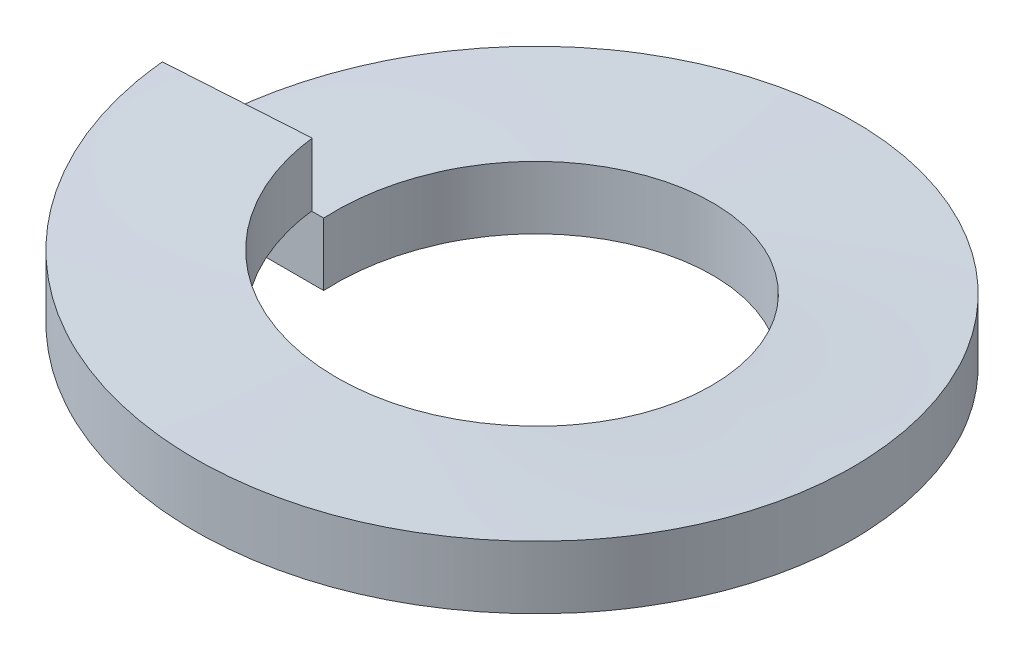
ISO-10303-21;
HEADER;
FILE_DESCRIPTION(('STEP AP214'),'2;1');
FILE_NAME('part.step','',(''),(''),'','','');
FILE_SCHEMA(('AUTOMOTIVE_DESIGN { 1 0 10303 214 1 1 1 1 }'));
ENDSEC;
DATA;
#1=APPLICATION_CONTEXT('core data for automotive mechanical design processes');
#2=APPLICATION_PROTOCOL_DEFINITION('international standard','automotive_design',2000,#1);
#3=PRODUCT_CONTEXT('',#1,'mechanical');
#4=PRODUCT('Part','Part','',(#3));
#5=PRODUCT_RELATED_PRODUCT_CATEGORY('part','',(#4));
#6=PRODUCT_DEFINITION_FORMATION('','',#4);
#7=PRODUCT_DEFINITION_CONTEXT('part definition',#1,'design');
#8=PRODUCT_DEFINITION('design','',#6,#7);
#9=PRODUCT_DEFINITION_SHAPE('','',#8);
#10=(LENGTH_UNIT() NAMED_UNIT(*) SI_UNIT(.MILLI.,.METRE.));
#11=(NAMED_UNIT(*) PLANE_ANGLE_UNIT() SI_UNIT($,.RADIAN.));
#12=(NAMED_UNIT(*) SI_UNIT($,.STERADIAN.) SOLID_ANGLE_UNIT());
#13=UNCERTAINTY_MEASURE_WITH_UNIT(LENGTH_MEASURE(1.E-05),#10,'distance_accuracy_value','');
#14=(GEOMETRIC_REPRESENTATION_CONTEXT(3) GLOBAL_UNCERTAINTY_ASSIGNED_CONTEXT((#13)) GLOBAL_UNIT_ASSIGNED_CONTEXT((#10,
#11,#12)) REPRESENTATION_CONTEXT('',''));
#15=CARTESIAN_POINT('',(0.,0.,0.));
#16=DIRECTION('',(0.,0.,1.));
#17=DIRECTION('',(1.,0.,0.));
#18=AXIS2_PLACEMENT_3D('',#15,#16,#17);
#19=CARTESIAN_POINT('',(-2.667,0.,0.));
#20=DIRECTION('',(0.,0.,1.));
#21=DIRECTION('',(1.,0.,0.));
#22=AXIS2_PLACEMENT_3D('',#19,#20,#21);
#23=PLANE('',#22);
#24=DIRECTION('',(0.,-1.,0.));
#25=VECTOR('',#24,1.);
#26=CARTESIAN_POINT('',(-2.667,0.508,0.));
#27=LINE('',#26,#25);
#28=CARTESIAN_POINT('',(-2.667,0.508,0.));
#29=VERTEX_POINT('',#28);
#30=CARTESIAN_POINT('',(-2.667,0.,0.));
#31=VERTEX_POINT('',#30);
#32=EDGE_CURVE('E84',#29,#31,#27,.T.);
#33=ORIENTED_EDGE('',*,*,#32,.T.);
#34=DIRECTION('',(1.,0.,0.));
#35=VECTOR('',#34,1.);
#36=CARTESIAN_POINT('',(-2.667,0.,0.));
#37=LINE('',#36,#35);
#38=CARTESIAN_POINT('',(-1.524,0.,0.));
#39=VERTEX_POINT('',#38);
#40=EDGE_CURVE('E77',#31,#39,#37,.T.);
#41=ORIENTED_EDGE('',*,*,#40,.T.);
#42=DIRECTION('',(0.,1.,0.));
#43=VECTOR('',#42,1.);
#44=CARTESIAN_POINT('',(-1.524,0.508,0.));
#45=LINE('',#44,#43);
#46=CARTESIAN_POINT('',(-1.524,0.508,0.));
#47=VERTEX_POINT('',#46);
#48=EDGE_CURVE('E72',#39,#47,#45,.T.);
#49=ORIENTED_EDGE('',*,*,#48,.T.);
#50=DIRECTION('',(-1.,0.,0.));
#51=VECTOR('',#50,1.);
#52=CARTESIAN_POINT('',(-2.667,0.508,0.));
#53=LINE('',#52,#51);
#54=EDGE_CURVE('E67',#47,#29,#53,.T.);
#55=ORIENTED_EDGE('',*,*,#54,.T.);
#56=EDGE_LOOP('',(#33,#41,#49,#55));
#57=FACE_BOUND('',#56,.T.);
#58=ADVANCED_FACE('F32',(#57),#23,.T.);
#59=CARTESIAN_POINT('',(-2.6617372847182,0.6096,0.167462315584643));
#60=DIRECTION('',(0.0627905195293,0.,0.998026728428272));
#61=DIRECTION('',(0.998026728428272,0.,-0.0627905195293));
#62=AXIS2_PLACEMENT_3D('',#59,#60,#61);
#63=PLANE('',#62);
#64=DIRECTION('',(0.,-1.,0.));
#65=VECTOR('',#64,1.);
#66=CARTESIAN_POINT('',(-2.6617372847182,1.1176,0.167462315584643));
#67=LINE('',#66,#65);
#68=CARTESIAN_POINT('',(-2.6617372847182,1.1176,0.167462315584644));
#69=VERTEX_POINT('',#68);
#70=CARTESIAN_POINT('',(-2.6617372847182,0.6096,0.167462315584642));
#71=VERTEX_POINT('',#70);
#72=EDGE_CURVE('E92',#69,#71,#67,.T.);
#73=ORIENTED_EDGE('',*,*,#72,.F.);
#74=DIRECTION('',(-0.998026728428272,0.,0.0627905195293));
#75=VECTOR('',#74,1.);
#76=CARTESIAN_POINT('',(-2.6617372847182,1.1176,0.167462315584643));
#77=LINE('',#76,#75);
#78=CARTESIAN_POINT('',(-1.52099273412469,1.1176,0.0956927517626538));
#79=VERTEX_POINT('',#78);
#80=EDGE_CURVE('E11',#79,#69,#77,.T.);
#81=ORIENTED_EDGE('',*,*,#80,.F.);
#82=DIRECTION('',(0.,1.,0.));
#83=VECTOR('',#82,1.);
#84=CARTESIAN_POINT('',(-1.52099273412469,1.1176,0.0956927517626532));
#85=LINE('',#84,#83);
#86=CARTESIAN_POINT('',(-1.52099273412469,0.6096,0.0956927517626525));
#87=VERTEX_POINT('',#86);
#88=EDGE_CURVE('E46',#87,#79,#85,.T.);
#89=ORIENTED_EDGE('',*,*,#88,.F.);
#90=DIRECTION('',(0.998026728428272,0.,-0.0627905195293));
#91=VECTOR('',#90,1.);
#92=CARTESIAN_POINT('',(-2.6617372847182,0.6096,0.167462315584643));
#93=LINE('',#92,#91);
#94=EDGE_CURVE('E55',#71,#87,#93,.T.);
#95=ORIENTED_EDGE('',*,*,#94,.F.);
#96=EDGE_LOOP('',(#73,#81,#89,#95));
#97=FACE_BOUND('',#96,.T.);
#98=ADVANCED_FACE('F138',(#97),#63,.F.);
#99=CARTESIAN_POINT('',(0.,0.,0.));
#100=DIRECTION('',(0.,1.,0.));
#101=DIRECTION('',(0.,0.,1.));
#102=AXIS2_PLACEMENT_3D('',#99,#100,#101);
#103=CYLINDRICAL_SURFACE('',#102,2.667);
#104=CARTESIAN_POINT('',(-2.667,0.,0.));
#105=CARTESIAN_POINT('',(-2.667,0.0508,-1.52122994243868));
#106=CARTESIAN_POINT('',(-1.35761345580623,0.1016,-2.29559898601952));
#107=CARTESIAN_POINT('',(-0.0482269116124696,0.1524,-3.06996802960036));
#108=CARTESIAN_POINT('',(1.28483704882929,0.2032,-2.33710991567698));
#109=CARTESIAN_POINT('',(2.61790100927104,0.254,-1.6042518017536));
#110=CARTESIAN_POINT('',(2.66568399649541,0.3048,-0.0837724944613491));
#111=CARTESIAN_POINT('',(2.71346698371977,0.3556,1.4367068128309));
#112=CARTESIAN_POINT('',(1.42905006220896,0.4064,2.25182257731389));
#113=CARTESIAN_POINT('',(0.144633140698153,0.4572,3.06693834179688));
#114=CARTESIAN_POINT('',(-1.2107926628054,0.508,2.37631440001036));
#115=CARTESIAN_POINT('',(-2.56621846630895,0.5588,1.68569045822385));
#116=CARTESIAN_POINT('',(-2.6617372847182,0.6096,0.167462315584641));
#117=(BOUNDED_CURVE() B_SPLINE_CURVE(2,(#104,#105,#106,#107,#108,#109,#110,#111,#112,#113,#114,
#115,#116),.UNSPECIFIED.,.F.,.F.) B_SPLINE_CURVE_WITH_KNOTS((3,2,2,2,2,2,3),(0.,
0.166666666666667,0.333333333333333,0.5,0.666666666666667,0.833333333333333,1.),
.UNSPECIFIED.) CURVE() GEOMETRIC_REPRESENTATION_ITEM() RATIONAL_B_SPLINE_CURVE((1.,
0.868631514438191,1.,0.868631514438191,1.,0.868631514438191,1.,0.868631514438191,1.,
0.868631514438191,1.,0.868631514438191,1.)) REPRESENTATION_ITEM(''));
#118=EDGE_CURVE('E87',#31,#71,#117,.T.);
#119=ORIENTED_EDGE('',*,*,#118,.F.);
#120=ORIENTED_EDGE('',*,*,#32,.F.);
#121=CARTESIAN_POINT('',(-2.667,0.508,0.));
#122=CARTESIAN_POINT('',(-2.667,0.5588,-1.52122994243868));
#123=CARTESIAN_POINT('',(-1.35761345580624,0.6096,-2.29559898601952));
#124=CARTESIAN_POINT('',(-0.0482269116124709,0.6604,-3.06996802960036));
#125=CARTESIAN_POINT('',(1.28483704882928,0.7112,-2.33710991567698));
#126=CARTESIAN_POINT('',(2.61790100927104,0.762,-1.6042518017536));
#127=CARTESIAN_POINT('',(2.66568399649541,0.8128,-0.0837724944613514));
#128=CARTESIAN_POINT('',(2.71346698371977,0.8636,1.43670681283089));
#129=CARTESIAN_POINT('',(1.42905006220897,0.9144,2.25182257731389));
#130=CARTESIAN_POINT('',(0.144633140698155,0.9652,3.06693834179688));
#131=CARTESIAN_POINT('',(-1.2107926628054,1.016,2.37631440001036));
#132=CARTESIAN_POINT('',(-2.56621846630895,1.0668,1.68569045822385));
#133=CARTESIAN_POINT('',(-2.6617372847182,1.1176,0.167462315584645));
#134=(BOUNDED_CURVE() B_SPLINE_CURVE(2,(#121,#122,#123,#124,#125,#126,#127,#128,#129,#130,#131,
#132,#133),.UNSPECIFIED.,.F.,.F.) B_SPLINE_CURVE_WITH_KNOTS((3,2,2,2,2,2,3),(0.,
0.166666666666667,0.333333333333333,0.5,0.666666666666667,0.833333333333333,1.),
.UNSPECIFIED.) CURVE() GEOMETRIC_REPRESENTATION_ITEM() RATIONAL_B_SPLINE_CURVE((1.,
0.868631514438191,1.,0.868631514438191,1.,0.868631514438191,1.,0.868631514438191,1.,
0.868631514438191,1.,0.868631514438191,1.)) REPRESENTATION_ITEM(''));
#135=EDGE_CURVE('E86',#29,#69,#134,.T.);
#136=ORIENTED_EDGE('',*,*,#135,.T.);
#137=ORIENTED_EDGE('',*,*,#72,.T.);
#138=EDGE_LOOP('',(#119,#120,#136,#137));
#139=FACE_BOUND('',#138,.T.);
#140=ADVANCED_FACE('F85',(#139),#103,.T.);
#141=CARTESIAN_POINT('',(-2.667,0.,0.));
#142=CARTESIAN_POINT('',(-2.667,0.0508,-1.52122994243868));
#143=CARTESIAN_POINT('',(-1.35761345580623,0.1016,-2.29559898601952));
#144=CARTESIAN_POINT('',(-0.0482269116124696,0.1524,-3.06996802960036));
#145=CARTESIAN_POINT('',(1.28483704882929,0.2032,-2.33710991567698));
#146=CARTESIAN_POINT('',(2.61790100927104,0.254,-1.6042518017536));
#147=CARTESIAN_POINT('',(2.66568399649541,0.3048,-0.0837724944613491));
#148=CARTESIAN_POINT('',(2.71346698371977,0.3556,1.4367068128309));
#149=CARTESIAN_POINT('',(1.42905006220896,0.4064,2.25182257731389));
#150=CARTESIAN_POINT('',(0.144633140698153,0.4572,3.06693834179688));
#151=CARTESIAN_POINT('',(-1.2107926628054,0.508,2.37631440001036));
#152=CARTESIAN_POINT('',(-2.56621846630895,0.5588,1.68569045822385));
#153=CARTESIAN_POINT('',(-2.6617372847182,0.6096,0.167462315584641));
#154=CARTESIAN_POINT('',(-1.524,0.,0.));
#155=CARTESIAN_POINT('',(-1.524,0.0508,-0.869274252822104));
#156=CARTESIAN_POINT('',(-0.775779117603563,0.1016,-1.31177084915401));
#157=CARTESIAN_POINT('',(-0.0275582352071255,0.1524,-1.75426744548592));
#158=CARTESIAN_POINT('',(0.73419259933102,0.2032,-1.33549138038684));
#159=CARTESIAN_POINT('',(1.49594343386917,0.254,-0.916715315287769));
#160=CARTESIAN_POINT('',(1.52324799799737,0.3048,-0.0478699968350566));
#161=CARTESIAN_POINT('',(1.55055256212558,0.3556,0.820975321617656));
#162=CARTESIAN_POINT('',(0.816600035547979,0.4064,1.28675575846508));
#163=CARTESIAN_POINT('',(0.082647508970373,0.4572,1.7525361953125));
#164=CARTESIAN_POINT('',(-0.691881521603085,0.508,1.35789394286306));
#165=CARTESIAN_POINT('',(-1.46641055217654,0.5588,0.963251690413627));
#166=CARTESIAN_POINT('',(-1.52099273412469,0.6096,0.0956927517626518));
#167=(BOUNDED_SURFACE() B_SPLINE_SURFACE(1,2,((#141,#142,#143,#144,#145,#146,#147,#148,#149,
#150,#151,#152,#153),(#154,#155,#156,#157,#158,#159,#160,#161,#162,#163,#164,#165,#166)),
.UNSPECIFIED.,.F.,.F.,.F.) B_SPLINE_SURFACE_WITH_KNOTS((2,2),(3,2,2,2,2,2,3),(0.,1.),(0.,
0.166666666666667,0.333333333333333,0.5,0.666666666666667,0.833333333333333,1.),
.UNSPECIFIED.) GEOMETRIC_REPRESENTATION_ITEM() RATIONAL_B_SPLINE_SURFACE(((1.,0.868631514438191,
1.,0.868631514438191,1.,0.868631514438191,1.,0.868631514438191,1.,0.868631514438191,1.,
0.868631514438191,1.),(1.,0.868631514438191,1.,0.868631514438191,1.,0.868631514438191,1.,
0.868631514438191,1.,0.868631514438191,1.,0.868631514438191,1.))) REPRESENTATION_ITEM('') SURFACE());
#168=CARTESIAN_POINT('',(-1.524,0.,0.));
#169=CARTESIAN_POINT('',(-1.524,0.0508,-0.869274252822103));
#170=CARTESIAN_POINT('',(-0.775779117603563,0.1016,-1.31177084915401));
#171=CARTESIAN_POINT('',(-0.0275582352071255,0.1524,-1.75426744548592));
#172=CARTESIAN_POINT('',(0.73419259933102,0.2032,-1.33549138038684));
#173=CARTESIAN_POINT('',(1.49594343386917,0.254,-0.916715315287769));
#174=CARTESIAN_POINT('',(1.52324799799737,0.3048,-0.0478699968350566));
#175=CARTESIAN_POINT('',(1.55055256212558,0.3556,0.820975321617656));
#176=CARTESIAN_POINT('',(0.816600035547979,0.4064,1.28675575846508));
#177=CARTESIAN_POINT('',(0.082647508970373,0.4572,1.7525361953125));
#178=CARTESIAN_POINT('',(-0.691881521603085,0.508,1.35789394286306));
#179=CARTESIAN_POINT('',(-1.46641055217654,0.5588,0.963251690413627));
#180=CARTESIAN_POINT('',(-1.52099273412469,0.6096,0.0956927517626518));
#181=(BOUNDED_CURVE() B_SPLINE_CURVE(2,(#168,#169,#170,#171,#172,#173,#174,#175,#176,#177,#178,
#179,#180),.UNSPECIFIED.,.F.,.F.) B_SPLINE_CURVE_WITH_KNOTS((3,2,2,2,2,2,3),(0.,
0.166666666666667,0.333333333333333,0.5,0.666666666666667,0.833333333333333,1.),
.UNSPECIFIED.) CURVE() GEOMETRIC_REPRESENTATION_ITEM() RATIONAL_B_SPLINE_CURVE((1.,
0.868631514438191,1.,0.868631514438191,1.,0.868631514438191,1.,0.868631514438191,1.,
0.868631514438191,1.,0.868631514438191,1.)) REPRESENTATION_ITEM(''));
#182=EDGE_CURVE('E107',#39,#87,#181,.T.);
#183=ORIENTED_EDGE('',*,*,#182,.F.);
#184=ORIENTED_EDGE('',*,*,#40,.F.);
#185=ORIENTED_EDGE('',*,*,#118,.T.);
#186=ORIENTED_EDGE('',*,*,#94,.T.);
#187=EDGE_LOOP('',(#183,#184,#185,#186));
#188=FACE_BOUND('',#187,.T.);
#189=ADVANCED_FACE('F125',(#188),#167,.F.);
#190=CARTESIAN_POINT('',(0.,0.,0.));
#191=DIRECTION('',(0.,1.,0.));
#192=DIRECTION('',(0.,0.,1.));
#193=AXIS2_PLACEMENT_3D('',#190,#191,#192);
#194=CYLINDRICAL_SURFACE('',#193,1.524);
#195=CARTESIAN_POINT('',(-1.524,0.508,0.));
#196=CARTESIAN_POINT('',(-1.524,0.5588,-0.869274252822104));
#197=CARTESIAN_POINT('',(-0.775779117603563,0.6096,-1.31177084915401));
#198=CARTESIAN_POINT('',(-0.0275582352071262,0.6604,-1.75426744548592));
#199=CARTESIAN_POINT('',(0.73419259933102,0.7112,-1.33549138038685));
#200=CARTESIAN_POINT('',(1.49594343386917,0.762,-0.91671531528777));
#201=CARTESIAN_POINT('',(1.52324799799738,0.8128,-0.047869996835058));
#202=CARTESIAN_POINT('',(1.55055256212558,0.8636,0.820975321617654));
#203=CARTESIAN_POINT('',(0.81660003554798,0.9144,1.28675575846508));
#204=CARTESIAN_POINT('',(0.0826475089703746,0.9652,1.7525361953125));
#205=CARTESIAN_POINT('',(-0.691881521603084,1.016,1.35789394286307));
#206=CARTESIAN_POINT('',(-1.46641055217654,1.0668,0.96325169041363));
#207=CARTESIAN_POINT('',(-1.52099273412469,1.1176,0.0956927517626545));
#208=(BOUNDED_CURVE() B_SPLINE_CURVE(2,(#195,#196,#197,#198,#199,#200,#201,#202,#203,#204,#205,
#206,#207),.UNSPECIFIED.,.F.,.F.) B_SPLINE_CURVE_WITH_KNOTS((3,2,2,2,2,2,3),(0.,
0.166666666666667,0.333333333333333,0.5,0.666666666666667,0.833333333333333,1.),
.UNSPECIFIED.) CURVE() GEOMETRIC_REPRESENTATION_ITEM() RATIONAL_B_SPLINE_CURVE((1.,
0.868631514438191,1.,0.868631514438191,1.,0.868631514438191,1.,0.868631514438191,1.,
0.868631514438191,1.,0.868631514438191,1.)) REPRESENTATION_ITEM(''));
#209=EDGE_CURVE('E39',#47,#79,#208,.T.);
#210=ORIENTED_EDGE('',*,*,#209,.F.);
#211=ORIENTED_EDGE('',*,*,#48,.F.);
#212=ORIENTED_EDGE('',*,*,#182,.T.);
#213=ORIENTED_EDGE('',*,*,#88,.T.);
#214=EDGE_LOOP('',(#210,#211,#212,#213));
#215=FACE_BOUND('',#214,.T.);
#216=ADVANCED_FACE('F123',(#215),#194,.F.);
#217=CARTESIAN_POINT('',(-1.524,0.508,0.));
#218=CARTESIAN_POINT('',(-1.524,0.5588,-0.869274252822104));
#219=CARTESIAN_POINT('',(-0.775779117603563,0.6096,-1.31177084915401));
#220=CARTESIAN_POINT('',(-0.0275582352071262,0.6604,-1.75426744548592));
#221=CARTESIAN_POINT('',(0.73419259933102,0.7112,-1.33549138038685));
#222=CARTESIAN_POINT('',(1.49594343386917,0.762,-0.91671531528777));
#223=CARTESIAN_POINT('',(1.52324799799738,0.8128,-0.047869996835058));
#224=CARTESIAN_POINT('',(1.55055256212558,0.8636,0.820975321617654));
#225=CARTESIAN_POINT('',(0.81660003554798,0.9144,1.28675575846508));
#226=CARTESIAN_POINT('',(0.0826475089703746,0.9652,1.7525361953125));
#227=CARTESIAN_POINT('',(-0.691881521603084,1.016,1.35789394286307));
#228=CARTESIAN_POINT('',(-1.46641055217654,1.0668,0.96325169041363));
#229=CARTESIAN_POINT('',(-1.52099273412469,1.1176,0.0956927517626545));
#230=CARTESIAN_POINT('',(-2.667,0.508,0.));
#231=CARTESIAN_POINT('',(-2.667,0.5588,-1.52122994243868));
#232=CARTESIAN_POINT('',(-1.35761345580624,0.6096,-2.29559898601952));
#233=CARTESIAN_POINT('',(-0.0482269116124709,0.6604,-3.06996802960036));
#234=CARTESIAN_POINT('',(1.28483704882928,0.7112,-2.33710991567698));
#235=CARTESIAN_POINT('',(2.61790100927104,0.762,-1.6042518017536));
#236=CARTESIAN_POINT('',(2.66568399649541,0.8128,-0.0837724944613514));
#237=CARTESIAN_POINT('',(2.71346698371977,0.8636,1.43670681283089));
#238=CARTESIAN_POINT('',(1.42905006220897,0.9144,2.25182257731389));
#239=CARTESIAN_POINT('',(0.144633140698155,0.9652,3.06693834179688));
#240=CARTESIAN_POINT('',(-1.2107926628054,1.016,2.37631440001036));
#241=CARTESIAN_POINT('',(-2.56621846630895,1.0668,1.68569045822385));
#242=CARTESIAN_POINT('',(-2.6617372847182,1.1176,0.167462315584645));
#243=(BOUNDED_SURFACE() B_SPLINE_SURFACE(1,2,((#217,#218,#219,#220,#221,#222,#223,#224,#225,
#226,#227,#228,#229),(#230,#231,#232,#233,#234,#235,#236,#237,#238,#239,#240,#241,#242)),
.UNSPECIFIED.,.F.,.F.,.F.) B_SPLINE_SURFACE_WITH_KNOTS((2,2),(3,2,2,2,2,2,3),(0.,1.),(0.,
0.166666666666667,0.333333333333333,0.5,0.666666666666667,0.833333333333333,1.),
.UNSPECIFIED.) GEOMETRIC_REPRESENTATION_ITEM() RATIONAL_B_SPLINE_SURFACE(((1.,0.868631514438191,
1.,0.868631514438191,1.,0.868631514438191,1.,0.868631514438191,1.,0.868631514438191,1.,
0.868631514438191,1.),(1.,0.868631514438191,1.,0.868631514438191,1.,0.868631514438191,1.,
0.868631514438191,1.,0.868631514438191,1.,0.868631514438191,1.))) REPRESENTATION_ITEM('') SURFACE());
#244=ORIENTED_EDGE('',*,*,#80,.T.);
#245=ORIENTED_EDGE('',*,*,#135,.F.);
#246=ORIENTED_EDGE('',*,*,#54,.F.);
#247=ORIENTED_EDGE('',*,*,#209,.T.);
#248=EDGE_LOOP('',(#244,#245,#246,#247));
#249=FACE_BOUND('',#248,.T.);
#250=ADVANCED_FACE('F90',(#249),#243,.F.);
#251=CLOSED_SHELL('',(#58,#98,#140,#189,#216,#250));
#252=MANIFOLD_SOLID_BREP('B2',#251);
#253=ADVANCED_BREP_SHAPE_REPRESENTATION('',(#18,#252),#14);
#254=SHAPE_DEFINITION_REPRESENTATION(#9,#253);
ENDSEC;
END-ISO-10303-21;
